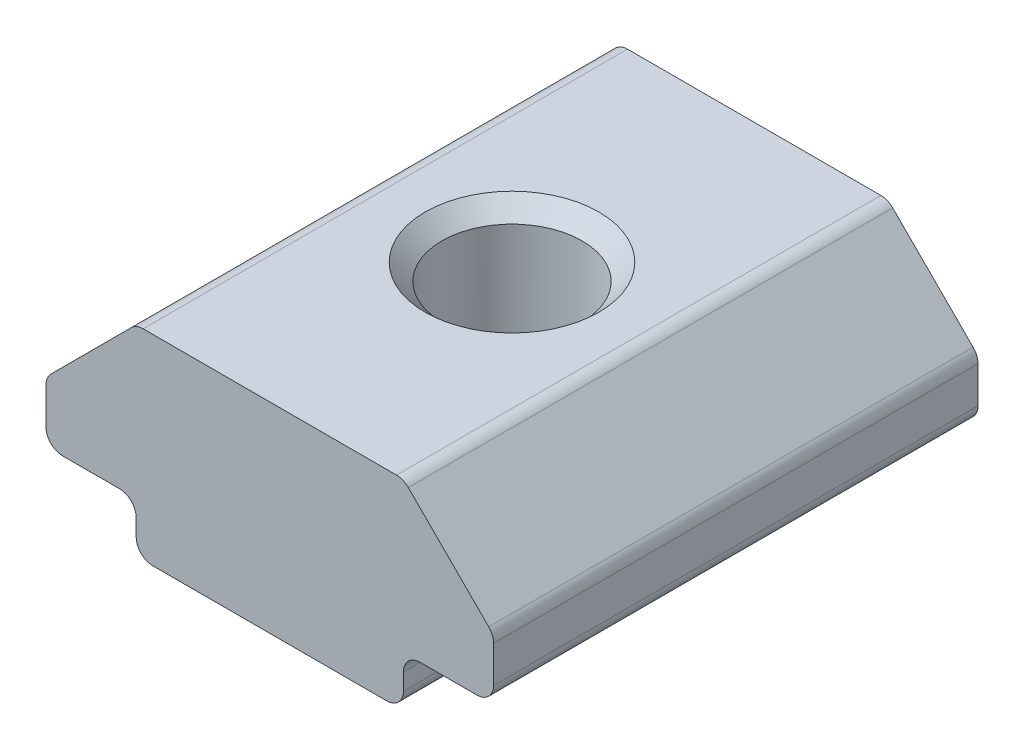
ISO-10303-21;
HEADER;
FILE_DESCRIPTION(('STEP AP214'),'2;1');
FILE_NAME('part.step','',(''),(''),'','','');
FILE_SCHEMA(('AUTOMOTIVE_DESIGN { 1 0 10303 214 1 1 1 1 }'));
ENDSEC;
DATA;
#1=APPLICATION_CONTEXT('core data for automotive mechanical design processes');
#2=APPLICATION_PROTOCOL_DEFINITION('international standard','automotive_design',2000,#1);
#3=PRODUCT_CONTEXT('',#1,'mechanical');
#4=PRODUCT('Part','Part','',(#3));
#5=PRODUCT_RELATED_PRODUCT_CATEGORY('part','',(#4));
#6=PRODUCT_DEFINITION_FORMATION('','',#4);
#7=PRODUCT_DEFINITION_CONTEXT('part definition',#1,'design');
#8=PRODUCT_DEFINITION('design','',#6,#7);
#9=PRODUCT_DEFINITION_SHAPE('','',#8);
#10=(LENGTH_UNIT() NAMED_UNIT(*) SI_UNIT(.MILLI.,.METRE.));
#11=(NAMED_UNIT(*) PLANE_ANGLE_UNIT() SI_UNIT($,.RADIAN.));
#12=(NAMED_UNIT(*) SI_UNIT($,.STERADIAN.) SOLID_ANGLE_UNIT());
#13=UNCERTAINTY_MEASURE_WITH_UNIT(LENGTH_MEASURE(1.E-05),#10,'distance_accuracy_value','');
#14=(GEOMETRIC_REPRESENTATION_CONTEXT(3) GLOBAL_UNCERTAINTY_ASSIGNED_CONTEXT((#13)) GLOBAL_UNIT_ASSIGNED_CONTEXT((#10,
#11,#12)) REPRESENTATION_CONTEXT('',''));
#15=CARTESIAN_POINT('',(0.,0.,0.));
#16=DIRECTION('',(0.,0.,1.));
#17=DIRECTION('',(1.,0.,0.));
#18=AXIS2_PLACEMENT_3D('',#15,#16,#17);
#19=CARTESIAN_POINT('',(-5.44683172709392,0.709717631728837,6.48747320730172));
#20=DIRECTION('',(1.,0.,0.));
#21=DIRECTION('',(0.,0.,-1.));
#22=AXIS2_PLACEMENT_3D('',#19,#20,#21);
#23=PLANE('',#22);
#24=DIRECTION('',(0.,-1.,0.));
#25=VECTOR('',#24,1.);
#26=CARTESIAN_POINT('',(-5.44683172709392,0.709717631728837,6.48747320730172));
#27=LINE('',#26,#25);
#28=CARTESIAN_POINT('',(-5.44683172709392,0.209717631728837,6.48747320730172));
#29=VERTEX_POINT('',#28);
#30=CARTESIAN_POINT('',(-5.44683172709392,-0.290282368271163,6.48747320730172));
#31=VERTEX_POINT('',#30);
#32=EDGE_CURVE('E204',#29,#31,#27,.T.);
#33=ORIENTED_EDGE('',*,*,#32,.F.);
#34=DIRECTION('',(0.,0.,-1.));
#35=VECTOR('',#34,1.);
#36=CARTESIAN_POINT('',(-5.44683172709392,0.209717631728837,-8.01252679269828));
#37=LINE('',#36,#35);
#38=CARTESIAN_POINT('',(-5.44683172709392,0.209717631728837,-8.01252679269828));
#39=VERTEX_POINT('',#38);
#40=EDGE_CURVE('E288',#29,#39,#37,.T.);
#41=ORIENTED_EDGE('',*,*,#40,.T.);
#42=DIRECTION('',(0.,-1.,0.));
#43=VECTOR('',#42,1.);
#44=CARTESIAN_POINT('',(-5.44683172709392,0.709717631728837,-8.01252679269828));
#45=LINE('',#44,#43);
#46=CARTESIAN_POINT('',(-5.44683172709392,-0.290282368271163,-8.01252679269828));
#47=VERTEX_POINT('',#46);
#48=EDGE_CURVE('E178',#39,#47,#45,.T.);
#49=ORIENTED_EDGE('',*,*,#48,.T.);
#50=DIRECTION('',(0.,0.,-1.));
#51=VECTOR('',#50,1.);
#52=CARTESIAN_POINT('',(-5.44683172709392,-0.290282368271163,6.48747320730172));
#53=LINE('',#52,#51);
#54=EDGE_CURVE('E160',#47,#31,#53,.F.);
#55=ORIENTED_EDGE('',*,*,#54,.T.);
#56=EDGE_LOOP('',(#33,#41,#49,#55));
#57=FACE_BOUND('',#56,.T.);
#58=ADVANCED_FACE('F16',(#57),#23,.F.);
#59=CARTESIAN_POINT('',(-5.44683172709392,-0.790282368271163,6.48747320730172));
#60=DIRECTION('',(0.,1.,0.));
#61=DIRECTION('',(0.,0.,1.));
#62=AXIS2_PLACEMENT_3D('',#59,#60,#61);
#63=PLANE('',#62);
#64=CARTESIAN_POINT('',(-1.44683172709392,-0.790282368271163,-0.762526792698281));
#65=DIRECTION('',(0.,1.,0.));
#66=DIRECTION('',(0.,0.,1.));
#67=AXIS2_PLACEMENT_3D('',#64,#65,#66);
#68=CIRCLE('',#67,2.6);
#69=CARTESIAN_POINT('',(-1.44683172709392,-0.790282368271163,1.83747320730171));
#70=VERTEX_POINT('',#69);
#71=EDGE_CURVE('E271',#70,#70,#68,.T.);
#72=ORIENTED_EDGE('',*,*,#71,.T.);
#73=EDGE_LOOP('',(#72));
#74=FACE_BOUND('',#73,.T.);
#75=DIRECTION('',(1.,0.,0.));
#76=VECTOR('',#75,1.);
#77=CARTESIAN_POINT('',(-5.44683172709392,-0.790282368271163,6.48747320730172));
#78=LINE('',#77,#76);
#79=CARTESIAN_POINT('',(-4.94683172709392,-0.790282368271163,6.48747320730172));
#80=VERTEX_POINT('',#79);
#81=CARTESIAN_POINT('',(2.05316827290608,-0.790282368271163,6.48747320730172));
#82=VERTEX_POINT('',#81);
#83=EDGE_CURVE('E171',#80,#82,#78,.T.);
#84=ORIENTED_EDGE('',*,*,#83,.F.);
#85=DIRECTION('',(0.,0.,-1.));
#86=VECTOR('',#85,1.);
#87=CARTESIAN_POINT('',(-4.94683172709392,-0.790282368271163,6.48747320730172));
#88=LINE('',#87,#86);
#89=CARTESIAN_POINT('',(-4.94683172709392,-0.790282368271163,-8.01252679269828));
#90=VERTEX_POINT('',#89);
#91=EDGE_CURVE('E158',#80,#90,#88,.T.);
#92=ORIENTED_EDGE('',*,*,#91,.T.);
#93=DIRECTION('',(1.,0.,0.));
#94=VECTOR('',#93,1.);
#95=CARTESIAN_POINT('',(-5.44683172709392,-0.790282368271163,-8.01252679269828));
#96=LINE('',#95,#94);
#97=CARTESIAN_POINT('',(2.05316827290608,-0.790282368271163,-8.01252679269828));
#98=VERTEX_POINT('',#97);
#99=EDGE_CURVE('E168',#90,#98,#96,.T.);
#100=ORIENTED_EDGE('',*,*,#99,.T.);
#101=DIRECTION('',(0.,0.,-1.));
#102=VECTOR('',#101,1.);
#103=CARTESIAN_POINT('',(2.05316827290608,-0.790282368271163,6.48747320730172));
#104=LINE('',#103,#102);
#105=EDGE_CURVE('E173',#98,#82,#104,.F.);
#106=ORIENTED_EDGE('',*,*,#105,.T.);
#107=EDGE_LOOP('',(#84,#92,#100,#106));
#108=FACE_BOUND('',#107,.T.);
#109=ADVANCED_FACE('F167',(#74,#108),#63,.F.);
#110=CARTESIAN_POINT('',(2.55316827290608,-0.790282368271163,6.48747320730172));
#111=DIRECTION('',(-1.,0.,0.));
#112=DIRECTION('',(0.,0.,1.));
#113=AXIS2_PLACEMENT_3D('',#110,#111,#112);
#114=PLANE('',#113);
#115=DIRECTION('',(0.,1.,0.));
#116=VECTOR('',#115,1.);
#117=CARTESIAN_POINT('',(2.55316827290608,-0.790282368271163,-8.01252679269828));
#118=LINE('',#117,#116);
#119=CARTESIAN_POINT('',(2.55316827290608,-0.290282368271164,-8.01252679269828));
#120=VERTEX_POINT('',#119);
#121=CARTESIAN_POINT('',(2.55316827290608,0.209717631728837,-8.01252679269828));
#122=VERTEX_POINT('',#121);
#123=EDGE_CURVE('E177',#120,#122,#118,.T.);
#124=ORIENTED_EDGE('',*,*,#123,.T.);
#125=DIRECTION('',(0.,0.,-1.));
#126=VECTOR('',#125,1.);
#127=CARTESIAN_POINT('',(2.55316827290608,0.209717631728837,6.48747320730172));
#128=LINE('',#127,#126);
#129=CARTESIAN_POINT('',(2.55316827290608,0.209717631728837,6.48747320730172));
#130=VERTEX_POINT('',#129);
#131=EDGE_CURVE('E286',#122,#130,#128,.F.);
#132=ORIENTED_EDGE('',*,*,#131,.T.);
#133=DIRECTION('',(0.,1.,0.));
#134=VECTOR('',#133,1.);
#135=CARTESIAN_POINT('',(2.55316827290608,-0.790282368271163,6.48747320730172));
#136=LINE('',#135,#134);
#137=CARTESIAN_POINT('',(2.55316827290608,-0.290282368271164,6.48747320730172));
#138=VERTEX_POINT('',#137);
#139=EDGE_CURVE('E302',#138,#130,#136,.T.);
#140=ORIENTED_EDGE('',*,*,#139,.F.);
#141=DIRECTION('',(0.,0.,-1.));
#142=VECTOR('',#141,1.);
#143=CARTESIAN_POINT('',(2.55316827290608,-0.290282368271164,6.48747320730172));
#144=LINE('',#143,#142);
#145=EDGE_CURVE('E268',#138,#120,#144,.T.);
#146=ORIENTED_EDGE('',*,*,#145,.T.);
#147=EDGE_LOOP('',(#124,#132,#140,#146));
#148=FACE_BOUND('',#147,.T.);
#149=ADVANCED_FACE('F315',(#148),#114,.F.);
#150=CARTESIAN_POINT('',(2.55316827290608,0.709717631728837,6.48747320730172));
#151=DIRECTION('',(0.,1.,0.));
#152=DIRECTION('',(0.,0.,1.));
#153=AXIS2_PLACEMENT_3D('',#150,#151,#152);
#154=PLANE('',#153);
#155=DIRECTION('',(1.,0.,0.));
#156=VECTOR('',#155,1.);
#157=CARTESIAN_POINT('',(2.55316827290608,0.709717631728837,6.48747320730172));
#158=LINE('',#157,#156);
#159=CARTESIAN_POINT('',(3.05316827290608,0.709717631728837,6.48747320730172));
#160=VERTEX_POINT('',#159);
#161=CARTESIAN_POINT('',(4.75316827290608,0.709717631728837,6.48747320730172));
#162=VERTEX_POINT('',#161);
#163=EDGE_CURVE('E300',#160,#162,#158,.T.);
#164=ORIENTED_EDGE('',*,*,#163,.F.);
#165=DIRECTION('',(0.,0.,-1.));
#166=VECTOR('',#165,1.);
#167=CARTESIAN_POINT('',(3.05316827290608,0.709717631728837,-8.01252679269828));
#168=LINE('',#167,#166);
#169=CARTESIAN_POINT('',(3.05316827290608,0.709717631728837,-8.01252679269828));
#170=VERTEX_POINT('',#169);
#171=EDGE_CURVE('E283',#160,#170,#168,.T.);
#172=ORIENTED_EDGE('',*,*,#171,.T.);
#173=DIRECTION('',(1.,0.,0.));
#174=VECTOR('',#173,1.);
#175=CARTESIAN_POINT('',(2.55316827290608,0.709717631728837,-8.01252679269828));
#176=LINE('',#175,#174);
#177=CARTESIAN_POINT('',(4.75316827290608,0.709717631728837,-8.01252679269828));
#178=VERTEX_POINT('',#177);
#179=EDGE_CURVE('E181',#170,#178,#176,.T.);
#180=ORIENTED_EDGE('',*,*,#179,.T.);
#181=DIRECTION('',(0.,0.,-1.));
#182=VECTOR('',#181,1.);
#183=CARTESIAN_POINT('',(4.75316827290608,0.709717631728837,6.48747320730172));
#184=LINE('',#183,#182);
#185=EDGE_CURVE('E265',#178,#162,#184,.F.);
#186=ORIENTED_EDGE('',*,*,#185,.T.);
#187=EDGE_LOOP('',(#164,#172,#180,#186));
#188=FACE_BOUND('',#187,.T.);
#189=ADVANCED_FACE('F307',(#188),#154,.F.);
#190=CARTESIAN_POINT('',(5.25316827290608,0.709717631728837,6.48747320730172));
#191=DIRECTION('',(-1.,0.,0.));
#192=DIRECTION('',(0.,0.,1.));
#193=AXIS2_PLACEMENT_3D('',#190,#191,#192);
#194=PLANE('',#193);
#195=DIRECTION('',(0.,1.,0.));
#196=VECTOR('',#195,1.);
#197=CARTESIAN_POINT('',(5.25316827290608,0.709717631728837,-8.01252679269828));
#198=LINE('',#197,#196);
#199=CARTESIAN_POINT('',(5.25316827290608,1.20971763172884,-8.01252679269828));
#200=VERTEX_POINT('',#199);
#201=CARTESIAN_POINT('',(5.25316827290608,2.3026108505423,-8.01252679269828));
#202=VERTEX_POINT('',#201);
#203=EDGE_CURVE('E187',#200,#202,#198,.T.);
#204=ORIENTED_EDGE('',*,*,#203,.T.);
#205=DIRECTION('',(0.,0.,-1.));
#206=VECTOR('',#205,1.);
#207=CARTESIAN_POINT('',(5.25316827290608,2.3026108505423,6.48747320730172));
#208=LINE('',#207,#206);
#209=CARTESIAN_POINT('',(5.25316827290608,2.3026108505423,6.48747320730172));
#210=VERTEX_POINT('',#209);
#211=EDGE_CURVE('E263',#202,#210,#208,.F.);
#212=ORIENTED_EDGE('',*,*,#211,.T.);
#213=DIRECTION('',(0.,1.,0.));
#214=VECTOR('',#213,1.);
#215=CARTESIAN_POINT('',(5.25316827290608,0.709717631728837,6.48747320730172));
#216=LINE('',#215,#214);
#217=CARTESIAN_POINT('',(5.25316827290608,1.20971763172884,6.48747320730172));
#218=VERTEX_POINT('',#217);
#219=EDGE_CURVE('E311',#218,#210,#216,.T.);
#220=ORIENTED_EDGE('',*,*,#219,.F.);
#221=DIRECTION('',(0.,0.,-1.));
#222=VECTOR('',#221,1.);
#223=CARTESIAN_POINT('',(5.25316827290608,1.20971763172884,6.48747320730172));
#224=LINE('',#223,#222);
#225=EDGE_CURVE('E260',#218,#200,#224,.T.);
#226=ORIENTED_EDGE('',*,*,#225,.T.);
#227=EDGE_LOOP('',(#204,#212,#220,#226));
#228=FACE_BOUND('',#227,.T.);
#229=ADVANCED_FACE('F541',(#228),#194,.F.);
#230=CARTESIAN_POINT('',(5.25316827290608,2.50971763172885,6.48747320730172));
#231=DIRECTION('',(-0.707106781186546,-0.707106781186549,0.));
#232=DIRECTION('',(0.707106781186549,-0.707106781186546,0.));
#233=AXIS2_PLACEMENT_3D('',#230,#231,#232);
#234=PLANE('',#233);
#235=DIRECTION('',(-0.707106781186549,0.707106781186546,0.));
#236=VECTOR('',#235,1.);
#237=CARTESIAN_POINT('',(5.25316827290608,2.50971763172885,-8.01252679269828));
#238=LINE('',#237,#236);
#239=CARTESIAN_POINT('',(5.10672166349935,2.65616424113557,-8.01252679269828));
#240=VERTEX_POINT('',#239);
#241=CARTESIAN_POINT('',(2.6996148823128,5.06327102232211,-8.01252679269828));
#242=VERTEX_POINT('',#241);
#243=EDGE_CURVE('E190',#240,#242,#238,.T.);
#244=ORIENTED_EDGE('',*,*,#243,.T.);
#245=DIRECTION('',(0.,0.,-1.));
#246=VECTOR('',#245,1.);
#247=CARTESIAN_POINT('',(2.6996148823128,5.06327102232211,6.48747320730172));
#248=LINE('',#247,#246);
#249=CARTESIAN_POINT('',(2.6996148823128,5.06327102232211,6.48747320730172));
#250=VERTEX_POINT('',#249);
#251=EDGE_CURVE('E258',#242,#250,#248,.F.);
#252=ORIENTED_EDGE('',*,*,#251,.T.);
#253=DIRECTION('',(-0.707106781186549,0.707106781186546,0.));
#254=VECTOR('',#253,1.);
#255=CARTESIAN_POINT('',(5.25316827290608,2.50971763172885,6.48747320730172));
#256=LINE('',#255,#254);
#257=CARTESIAN_POINT('',(5.10672166349935,2.65616424113557,6.48747320730172));
#258=VERTEX_POINT('',#257);
#259=EDGE_CURVE('E326',#258,#250,#256,.T.);
#260=ORIENTED_EDGE('',*,*,#259,.F.);
#261=DIRECTION('',(0.,0.,-1.));
#262=VECTOR('',#261,1.);
#263=CARTESIAN_POINT('',(5.10672166349935,2.65616424113557,6.48747320730172));
#264=LINE('',#263,#262);
#265=EDGE_CURVE('E255',#258,#240,#264,.T.);
#266=ORIENTED_EDGE('',*,*,#265,.T.);
#267=EDGE_LOOP('',(#244,#252,#260,#266));
#268=FACE_BOUND('',#267,.T.);
#269=ADVANCED_FACE('F531',(#268),#234,.F.);
#270=CARTESIAN_POINT('',(2.55316827290608,5.20971763172883,6.48747320730172));
#271=DIRECTION('',(0.,-1.,0.));
#272=DIRECTION('',(0.,0.,-1.));
#273=AXIS2_PLACEMENT_3D('',#270,#271,#272);
#274=PLANE('',#273);
#275=CARTESIAN_POINT('',(-1.44683172709392,5.20971763172883,-0.762526792698281));
#276=DIRECTION('',(0.,-1.,0.));
#277=DIRECTION('',(0.,0.,-1.));
#278=AXIS2_PLACEMENT_3D('',#275,#276,#277);
#279=CIRCLE('',#278,2.6);
#280=CARTESIAN_POINT('',(-1.44683172709392,5.20971763172883,-3.36252679269828));
#281=VERTEX_POINT('',#280);
#282=EDGE_CURVE('E280',#281,#281,#279,.T.);
#283=ORIENTED_EDGE('',*,*,#282,.T.);
#284=EDGE_LOOP('',(#283));
#285=FACE_BOUND('',#284,.T.);
#286=DIRECTION('',(-1.,0.,0.));
#287=VECTOR('',#286,1.);
#288=CARTESIAN_POINT('',(2.55316827290608,5.20971763172883,-8.01252679269828));
#289=LINE('',#288,#287);
#290=CARTESIAN_POINT('',(2.34606149171953,5.20971763172883,-8.01252679269828));
#291=VERTEX_POINT('',#290);
#292=CARTESIAN_POINT('',(-5.23972494590737,5.20971763172883,-8.01252679269828));
#293=VERTEX_POINT('',#292);
#294=EDGE_CURVE('E193',#291,#293,#289,.T.);
#295=ORIENTED_EDGE('',*,*,#294,.T.);
#296=DIRECTION('',(0.,0.,-1.));
#297=VECTOR('',#296,1.);
#298=CARTESIAN_POINT('',(-5.23972494590737,5.20971763172883,6.48747320730172));
#299=LINE('',#298,#297);
#300=CARTESIAN_POINT('',(-5.23972494590737,5.20971763172883,6.48747320730172));
#301=VERTEX_POINT('',#300);
#302=EDGE_CURVE('E253',#293,#301,#299,.F.);
#303=ORIENTED_EDGE('',*,*,#302,.T.);
#304=DIRECTION('',(-1.,0.,0.));
#305=VECTOR('',#304,1.);
#306=CARTESIAN_POINT('',(2.55316827290608,5.20971763172883,6.48747320730172));
#307=LINE('',#306,#305);
#308=CARTESIAN_POINT('',(2.34606149171953,5.20971763172883,6.48747320730172));
#309=VERTEX_POINT('',#308);
#310=EDGE_CURVE('E329',#309,#301,#307,.T.);
#311=ORIENTED_EDGE('',*,*,#310,.F.);
#312=DIRECTION('',(0.,0.,-1.));
#313=VECTOR('',#312,1.);
#314=CARTESIAN_POINT('',(2.34606149171953,5.20971763172883,6.48747320730172));
#315=LINE('',#314,#313);
#316=EDGE_CURVE('E250',#309,#291,#315,.T.);
#317=ORIENTED_EDGE('',*,*,#316,.T.);
#318=EDGE_LOOP('',(#295,#303,#311,#317));
#319=FACE_BOUND('',#318,.T.);
#320=ADVANCED_FACE('F521',(#285,#319),#274,.F.);
#321=CARTESIAN_POINT('',(-8.14683172709392,2.50971763172884,6.48747320730172));
#322=DIRECTION('',(0.707106781186546,-0.707106781186549,0.));
#323=DIRECTION('',(0.707106781186549,0.707106781186546,0.));
#324=AXIS2_PLACEMENT_3D('',#321,#322,#323);
#325=PLANE('',#324);
#326=DIRECTION('',(-0.707106781186549,-0.707106781186546,0.));
#327=VECTOR('',#326,1.);
#328=CARTESIAN_POINT('',(-8.14683172709392,2.50971763172884,-8.01252679269828));
#329=LINE('',#328,#327);
#330=CARTESIAN_POINT('',(-5.59327833650065,5.06327102232211,-8.01252679269828));
#331=VERTEX_POINT('',#330);
#332=CARTESIAN_POINT('',(-8.00038511768719,2.65616424113557,-8.01252679269828));
#333=VERTEX_POINT('',#332);
#334=EDGE_CURVE('E196',#331,#333,#329,.T.);
#335=ORIENTED_EDGE('',*,*,#334,.T.);
#336=DIRECTION('',(0.,0.,-1.));
#337=VECTOR('',#336,1.);
#338=CARTESIAN_POINT('',(-8.00038511768719,2.65616424113557,6.48747320730172));
#339=LINE('',#338,#337);
#340=CARTESIAN_POINT('',(-8.00038511768719,2.65616424113557,6.48747320730172));
#341=VERTEX_POINT('',#340);
#342=EDGE_CURVE('E248',#333,#341,#339,.F.);
#343=ORIENTED_EDGE('',*,*,#342,.T.);
#344=DIRECTION('',(-0.707106781186549,-0.707106781186546,0.));
#345=VECTOR('',#344,1.);
#346=CARTESIAN_POINT('',(-8.14683172709392,2.50971763172884,6.48747320730172));
#347=LINE('',#346,#345);
#348=CARTESIAN_POINT('',(-5.59327833650065,5.06327102232211,6.48747320730172));
#349=VERTEX_POINT('',#348);
#350=EDGE_CURVE('E332',#349,#341,#347,.T.);
#351=ORIENTED_EDGE('',*,*,#350,.F.);
#352=DIRECTION('',(0.,0.,-1.));
#353=VECTOR('',#352,1.);
#354=CARTESIAN_POINT('',(-5.59327833650065,5.06327102232211,6.48747320730172));
#355=LINE('',#354,#353);
#356=EDGE_CURVE('E245',#349,#331,#355,.T.);
#357=ORIENTED_EDGE('',*,*,#356,.T.);
#358=EDGE_LOOP('',(#335,#343,#351,#357));
#359=FACE_BOUND('',#358,.T.);
#360=ADVANCED_FACE('F511',(#359),#325,.F.);
#361=CARTESIAN_POINT('',(-8.14683172709392,0.709717631728837,6.48747320730172));
#362=DIRECTION('',(1.,0.,0.));
#363=DIRECTION('',(0.,0.,-1.));
#364=AXIS2_PLACEMENT_3D('',#361,#362,#363);
#365=PLANE('',#364);
#366=DIRECTION('',(0.,-1.,0.));
#367=VECTOR('',#366,1.);
#368=CARTESIAN_POINT('',(-8.14683172709392,0.709717631728837,-8.01252679269828));
#369=LINE('',#368,#367);
#370=CARTESIAN_POINT('',(-8.14683172709392,2.3026108505423,-8.01252679269828));
#371=VERTEX_POINT('',#370);
#372=CARTESIAN_POINT('',(-8.14683172709392,1.20971763172884,-8.01252679269828));
#373=VERTEX_POINT('',#372);
#374=EDGE_CURVE('E199',#371,#373,#369,.T.);
#375=ORIENTED_EDGE('',*,*,#374,.T.);
#376=DIRECTION('',(0.,0.,-1.));
#377=VECTOR('',#376,1.);
#378=CARTESIAN_POINT('',(-8.14683172709392,1.20971763172884,6.48747320730172));
#379=LINE('',#378,#377);
#380=CARTESIAN_POINT('',(-8.14683172709392,1.20971763172884,6.48747320730172));
#381=VERTEX_POINT('',#380);
#382=EDGE_CURVE('E243',#373,#381,#379,.F.);
#383=ORIENTED_EDGE('',*,*,#382,.T.);
#384=DIRECTION('',(0.,-1.,0.));
#385=VECTOR('',#384,1.);
#386=CARTESIAN_POINT('',(-8.14683172709392,0.709717631728837,6.48747320730172));
#387=LINE('',#386,#385);
#388=CARTESIAN_POINT('',(-8.14683172709392,2.3026108505423,6.48747320730172));
#389=VERTEX_POINT('',#388);
#390=EDGE_CURVE('E335',#389,#381,#387,.T.);
#391=ORIENTED_EDGE('',*,*,#390,.F.);
#392=DIRECTION('',(0.,0.,-1.));
#393=VECTOR('',#392,1.);
#394=CARTESIAN_POINT('',(-8.14683172709392,2.3026108505423,6.48747320730172));
#395=LINE('',#394,#393);
#396=EDGE_CURVE('E240',#389,#371,#395,.T.);
#397=ORIENTED_EDGE('',*,*,#396,.T.);
#398=EDGE_LOOP('',(#375,#383,#391,#397));
#399=FACE_BOUND('',#398,.T.);
#400=ADVANCED_FACE('F502',(#399),#365,.F.);
#401=CARTESIAN_POINT('',(-8.14683172709392,0.709717631728837,6.48747320730172));
#402=DIRECTION('',(0.,1.,0.));
#403=DIRECTION('',(0.,0.,1.));
#404=AXIS2_PLACEMENT_3D('',#401,#402,#403);
#405=PLANE('',#404);
#406=DIRECTION('',(1.,0.,0.));
#407=VECTOR('',#406,1.);
#408=CARTESIAN_POINT('',(-8.14683172709392,0.709717631728837,-8.01252679269828));
#409=LINE('',#408,#407);
#410=CARTESIAN_POINT('',(-7.64683172709392,0.709717631728837,-8.01252679269828));
#411=VERTEX_POINT('',#410);
#412=CARTESIAN_POINT('',(-5.94683172709392,0.709717631728837,-8.01252679269828));
#413=VERTEX_POINT('',#412);
#414=EDGE_CURVE('E202',#411,#413,#409,.T.);
#415=ORIENTED_EDGE('',*,*,#414,.T.);
#416=DIRECTION('',(0.,0.,-1.));
#417=VECTOR('',#416,1.);
#418=CARTESIAN_POINT('',(-5.94683172709392,0.709717631728837,6.48747320730172));
#419=LINE('',#418,#417);
#420=CARTESIAN_POINT('',(-5.94683172709392,0.709717631728837,6.48747320730172));
#421=VERTEX_POINT('',#420);
#422=EDGE_CURVE('E37',#413,#421,#419,.F.);
#423=ORIENTED_EDGE('',*,*,#422,.T.);
#424=DIRECTION('',(1.,0.,0.));
#425=VECTOR('',#424,1.);
#426=CARTESIAN_POINT('',(-8.14683172709392,0.709717631728837,6.48747320730172));
#427=LINE('',#426,#425);
#428=CARTESIAN_POINT('',(-7.64683172709392,0.709717631728837,6.48747320730172));
#429=VERTEX_POINT('',#428);
#430=EDGE_CURVE('E205',#429,#421,#427,.T.);
#431=ORIENTED_EDGE('',*,*,#430,.F.);
#432=DIRECTION('',(0.,0.,-1.));
#433=VECTOR('',#432,1.);
#434=CARTESIAN_POINT('',(-7.64683172709392,0.709717631728837,6.48747320730172));
#435=LINE('',#434,#433);
#436=EDGE_CURVE('E237',#429,#411,#435,.T.);
#437=ORIENTED_EDGE('',*,*,#436,.T.);
#438=EDGE_LOOP('',(#415,#423,#431,#437));
#439=FACE_BOUND('',#438,.T.);
#440=ADVANCED_FACE('F493',(#439),#405,.F.);
#441=CARTESIAN_POINT('',(-1.44683172709392,-0.790282368271163,6.48747320730172));
#442=DIRECTION('',(0.,0.,1.));
#443=DIRECTION('',(1.,0.,0.));
#444=AXIS2_PLACEMENT_3D('',#441,#442,#443);
#445=PLANE('',#444);
#446=ORIENTED_EDGE('',*,*,#430,.T.);
#447=CARTESIAN_POINT('',(-5.94683172709392,0.209717631728837,6.48747320730172));
#448=DIRECTION('',(0.,0.,1.));
#449=DIRECTION('',(1.,0.,0.));
#450=AXIS2_PLACEMENT_3D('',#447,#448,#449);
#451=CIRCLE('',#450,0.5);
#452=EDGE_CURVE('E10',#421,#29,#451,.F.);
#453=ORIENTED_EDGE('',*,*,#452,.T.);
#454=ORIENTED_EDGE('',*,*,#32,.T.);
#455=CARTESIAN_POINT('',(-4.94683172709392,-0.290282368271163,6.48747320730172));
#456=DIRECTION('',(0.,0.,1.));
#457=DIRECTION('',(1.,0.,0.));
#458=AXIS2_PLACEMENT_3D('',#455,#456,#457);
#459=CIRCLE('',#458,0.5);
#460=EDGE_CURVE('E235',#31,#80,#459,.T.);
#461=ORIENTED_EDGE('',*,*,#460,.T.);
#462=ORIENTED_EDGE('',*,*,#83,.T.);
#463=CARTESIAN_POINT('',(2.05316827290608,-0.290282368271164,6.48747320730172));
#464=DIRECTION('',(0.,0.,1.));
#465=DIRECTION('',(1.,0.,0.));
#466=AXIS2_PLACEMENT_3D('',#463,#464,#465);
#467=CIRCLE('',#466,0.5);
#468=EDGE_CURVE('E221',#82,#138,#467,.T.);
#469=ORIENTED_EDGE('',*,*,#468,.T.);
#470=ORIENTED_EDGE('',*,*,#139,.T.);
#471=CARTESIAN_POINT('',(3.05316827290608,0.209717631728837,6.48747320730172));
#472=DIRECTION('',(0.,0.,1.));
#473=DIRECTION('',(1.,0.,0.));
#474=AXIS2_PLACEMENT_3D('',#471,#472,#473);
#475=CIRCLE('',#474,0.5);
#476=EDGE_CURVE('E294',#130,#160,#475,.F.);
#477=ORIENTED_EDGE('',*,*,#476,.T.);
#478=ORIENTED_EDGE('',*,*,#163,.T.);
#479=CARTESIAN_POINT('',(4.75316827290608,1.20971763172884,6.48747320730172));
#480=DIRECTION('',(0.,0.,1.));
#481=DIRECTION('',(1.,0.,0.));
#482=AXIS2_PLACEMENT_3D('',#479,#480,#481);
#483=CIRCLE('',#482,0.5);
#484=EDGE_CURVE('E223',#162,#218,#483,.T.);
#485=ORIENTED_EDGE('',*,*,#484,.T.);
#486=ORIENTED_EDGE('',*,*,#219,.T.);
#487=CARTESIAN_POINT('',(4.75316827290608,2.3026108505423,6.48747320730172));
#488=DIRECTION('',(0.,0.,1.));
#489=DIRECTION('',(1.,0.,0.));
#490=AXIS2_PLACEMENT_3D('',#487,#488,#489);
#491=CIRCLE('',#490,0.5);
#492=EDGE_CURVE('E225',#210,#258,#491,.T.);
#493=ORIENTED_EDGE('',*,*,#492,.T.);
#494=ORIENTED_EDGE('',*,*,#259,.T.);
#495=CARTESIAN_POINT('',(2.34606149171953,4.70971763172884,6.48747320730172));
#496=DIRECTION('',(0.,0.,1.));
#497=DIRECTION('',(1.,0.,0.));
#498=AXIS2_PLACEMENT_3D('',#495,#496,#497);
#499=CIRCLE('',#498,0.5);
#500=EDGE_CURVE('E227',#250,#309,#499,.T.);
#501=ORIENTED_EDGE('',*,*,#500,.T.);
#502=ORIENTED_EDGE('',*,*,#310,.T.);
#503=CARTESIAN_POINT('',(-5.23972494590737,4.70971763172884,6.48747320730172));
#504=DIRECTION('',(0.,0.,1.));
#505=DIRECTION('',(1.,0.,0.));
#506=AXIS2_PLACEMENT_3D('',#503,#504,#505);
#507=CIRCLE('',#506,0.5);
#508=EDGE_CURVE('E229',#301,#349,#507,.T.);
#509=ORIENTED_EDGE('',*,*,#508,.T.);
#510=ORIENTED_EDGE('',*,*,#350,.T.);
#511=CARTESIAN_POINT('',(-7.64683172709392,2.3026108505423,6.48747320730172));
#512=DIRECTION('',(0.,0.,1.));
#513=DIRECTION('',(1.,0.,0.));
#514=AXIS2_PLACEMENT_3D('',#511,#512,#513);
#515=CIRCLE('',#514,0.5);
#516=EDGE_CURVE('E231',#341,#389,#515,.T.);
#517=ORIENTED_EDGE('',*,*,#516,.T.);
#518=ORIENTED_EDGE('',*,*,#390,.T.);
#519=CARTESIAN_POINT('',(-7.64683172709392,1.20971763172884,6.48747320730172));
#520=DIRECTION('',(0.,0.,1.));
#521=DIRECTION('',(1.,0.,0.));
#522=AXIS2_PLACEMENT_3D('',#519,#520,#521);
#523=CIRCLE('',#522,0.5);
#524=EDGE_CURVE('E233',#381,#429,#523,.T.);
#525=ORIENTED_EDGE('',*,*,#524,.T.);
#526=EDGE_LOOP('',(#446,#453,#454,#461,#462,#469,#470,#477,#478,#485,#486,#493,#494,#501,#502,
#509,#510,#517,#518,#525));
#527=FACE_BOUND('',#526,.T.);
#528=ADVANCED_FACE('F299',(#527),#445,.T.);
#529=CARTESIAN_POINT('',(-1.44683172709392,-0.790282368271163,-8.01252679269828));
#530=DIRECTION('',(0.,0.,1.));
#531=DIRECTION('',(1.,0.,0.));
#532=AXIS2_PLACEMENT_3D('',#529,#530,#531);
#533=PLANE('',#532);
#534=ORIENTED_EDGE('',*,*,#99,.F.);
#535=CARTESIAN_POINT('',(-4.94683172709392,-0.290282368271163,-8.01252679269828));
#536=DIRECTION('',(0.,0.,1.));
#537=DIRECTION('',(1.,0.,0.));
#538=AXIS2_PLACEMENT_3D('',#535,#536,#537);
#539=CIRCLE('',#538,0.5);
#540=EDGE_CURVE('E154',#90,#47,#539,.F.);
#541=ORIENTED_EDGE('',*,*,#540,.T.);
#542=ORIENTED_EDGE('',*,*,#48,.F.);
#543=CARTESIAN_POINT('',(-5.94683172709392,0.209717631728837,-8.01252679269828));
#544=DIRECTION('',(0.,0.,1.));
#545=DIRECTION('',(1.,0.,0.));
#546=AXIS2_PLACEMENT_3D('',#543,#544,#545);
#547=CIRCLE('',#546,0.5);
#548=EDGE_CURVE('E24',#39,#413,#547,.T.);
#549=ORIENTED_EDGE('',*,*,#548,.T.);
#550=ORIENTED_EDGE('',*,*,#414,.F.);
#551=CARTESIAN_POINT('',(-7.64683172709392,1.20971763172884,-8.01252679269828));
#552=DIRECTION('',(0.,0.,1.));
#553=DIRECTION('',(1.,0.,0.));
#554=AXIS2_PLACEMENT_3D('',#551,#552,#553);
#555=CIRCLE('',#554,0.5);
#556=EDGE_CURVE('E162',#411,#373,#555,.F.);
#557=ORIENTED_EDGE('',*,*,#556,.T.);
#558=ORIENTED_EDGE('',*,*,#374,.F.);
#559=CARTESIAN_POINT('',(-7.64683172709392,2.3026108505423,-8.01252679269828));
#560=DIRECTION('',(0.,0.,1.));
#561=DIRECTION('',(1.,0.,0.));
#562=AXIS2_PLACEMENT_3D('',#559,#560,#561);
#563=CIRCLE('',#562,0.5);
#564=EDGE_CURVE('E217',#371,#333,#563,.F.);
#565=ORIENTED_EDGE('',*,*,#564,.T.);
#566=ORIENTED_EDGE('',*,*,#334,.F.);
#567=CARTESIAN_POINT('',(-5.23972494590737,4.70971763172884,-8.01252679269828));
#568=DIRECTION('',(0.,0.,1.));
#569=DIRECTION('',(1.,0.,0.));
#570=AXIS2_PLACEMENT_3D('',#567,#568,#569);
#571=CIRCLE('',#570,0.5);
#572=EDGE_CURVE('E215',#331,#293,#571,.F.);
#573=ORIENTED_EDGE('',*,*,#572,.T.);
#574=ORIENTED_EDGE('',*,*,#294,.F.);
#575=CARTESIAN_POINT('',(2.34606149171953,4.70971763172884,-8.01252679269828));
#576=DIRECTION('',(0.,0.,1.));
#577=DIRECTION('',(1.,0.,0.));
#578=AXIS2_PLACEMENT_3D('',#575,#576,#577);
#579=CIRCLE('',#578,0.5);
#580=EDGE_CURVE('E213',#291,#242,#579,.F.);
#581=ORIENTED_EDGE('',*,*,#580,.T.);
#582=ORIENTED_EDGE('',*,*,#243,.F.);
#583=CARTESIAN_POINT('',(4.75316827290608,2.3026108505423,-8.01252679269828));
#584=DIRECTION('',(0.,0.,1.));
#585=DIRECTION('',(1.,0.,0.));
#586=AXIS2_PLACEMENT_3D('',#583,#584,#585);
#587=CIRCLE('',#586,0.5);
#588=EDGE_CURVE('E211',#240,#202,#587,.F.);
#589=ORIENTED_EDGE('',*,*,#588,.T.);
#590=ORIENTED_EDGE('',*,*,#203,.F.);
#591=CARTESIAN_POINT('',(4.75316827290608,1.20971763172884,-8.01252679269828));
#592=DIRECTION('',(0.,0.,1.));
#593=DIRECTION('',(1.,0.,0.));
#594=AXIS2_PLACEMENT_3D('',#591,#592,#593);
#595=CIRCLE('',#594,0.5);
#596=EDGE_CURVE('E208',#200,#178,#595,.F.);
#597=ORIENTED_EDGE('',*,*,#596,.T.);
#598=ORIENTED_EDGE('',*,*,#179,.F.);
#599=CARTESIAN_POINT('',(3.05316827290608,0.209717631728837,-8.01252679269828));
#600=DIRECTION('',(0.,0.,1.));
#601=DIRECTION('',(1.,0.,0.));
#602=AXIS2_PLACEMENT_3D('',#599,#600,#601);
#603=CIRCLE('',#602,0.5);
#604=EDGE_CURVE('E292',#170,#122,#603,.T.);
#605=ORIENTED_EDGE('',*,*,#604,.T.);
#606=ORIENTED_EDGE('',*,*,#123,.F.);
#607=CARTESIAN_POINT('',(2.05316827290608,-0.290282368271164,-8.01252679269828));
#608=DIRECTION('',(0.,0.,1.));
#609=DIRECTION('',(1.,0.,0.));
#610=AXIS2_PLACEMENT_3D('',#607,#608,#609);
#611=CIRCLE('',#610,0.5);
#612=EDGE_CURVE('E172',#120,#98,#611,.F.);
#613=ORIENTED_EDGE('',*,*,#612,.T.);
#614=EDGE_LOOP('',(#534,#541,#542,#549,#550,#557,#558,#565,#566,#573,#574,#581,#582,#589,#590,
#597,#598,#605,#606,#613));
#615=FACE_BOUND('',#614,.T.);
#616=ADVANCED_FACE('F175',(#615),#533,.F.);
#617=CARTESIAN_POINT('',(-4.94683172709392,-0.290282368271163,6.48747320730172));
#618=DIRECTION('',(0.,0.,-1.));
#619=DIRECTION('',(-1.,0.,0.));
#620=AXIS2_PLACEMENT_3D('',#617,#618,#619);
#621=CYLINDRICAL_SURFACE('',#620,0.5);
#622=ORIENTED_EDGE('',*,*,#460,.F.);
#623=ORIENTED_EDGE('',*,*,#54,.F.);
#624=ORIENTED_EDGE('',*,*,#540,.F.);
#625=ORIENTED_EDGE('',*,*,#91,.F.);
#626=EDGE_LOOP('',(#622,#623,#624,#625));
#627=FACE_BOUND('',#626,.T.);
#628=ADVANCED_FACE('F157',(#627),#621,.T.);
#629=CARTESIAN_POINT('',(-7.64683172709392,1.20971763172884,6.48747320730172));
#630=DIRECTION('',(0.,0.,-1.));
#631=DIRECTION('',(-1.,0.,0.));
#632=AXIS2_PLACEMENT_3D('',#629,#630,#631);
#633=CYLINDRICAL_SURFACE('',#632,0.5);
#634=ORIENTED_EDGE('',*,*,#524,.F.);
#635=ORIENTED_EDGE('',*,*,#382,.F.);
#636=ORIENTED_EDGE('',*,*,#556,.F.);
#637=ORIENTED_EDGE('',*,*,#436,.F.);
#638=EDGE_LOOP('',(#634,#635,#636,#637));
#639=FACE_BOUND('',#638,.T.);
#640=ADVANCED_FACE('F356',(#639),#633,.T.);
#641=CARTESIAN_POINT('',(-7.64683172709392,2.3026108505423,6.48747320730172));
#642=DIRECTION('',(0.,0.,-1.));
#643=DIRECTION('',(-1.,0.,0.));
#644=AXIS2_PLACEMENT_3D('',#641,#642,#643);
#645=CYLINDRICAL_SURFACE('',#644,0.5);
#646=ORIENTED_EDGE('',*,*,#516,.F.);
#647=ORIENTED_EDGE('',*,*,#342,.F.);
#648=ORIENTED_EDGE('',*,*,#564,.F.);
#649=ORIENTED_EDGE('',*,*,#396,.F.);
#650=EDGE_LOOP('',(#646,#647,#648,#649));
#651=FACE_BOUND('',#650,.T.);
#652=ADVANCED_FACE('F359',(#651),#645,.T.);
#653=CARTESIAN_POINT('',(-5.23972494590737,4.70971763172884,6.48747320730172));
#654=DIRECTION('',(0.,0.,-1.));
#655=DIRECTION('',(-1.,0.,0.));
#656=AXIS2_PLACEMENT_3D('',#653,#654,#655);
#657=CYLINDRICAL_SURFACE('',#656,0.5);
#658=ORIENTED_EDGE('',*,*,#508,.F.);
#659=ORIENTED_EDGE('',*,*,#302,.F.);
#660=ORIENTED_EDGE('',*,*,#572,.F.);
#661=ORIENTED_EDGE('',*,*,#356,.F.);
#662=EDGE_LOOP('',(#658,#659,#660,#661));
#663=FACE_BOUND('',#662,.T.);
#664=ADVANCED_FACE('F363',(#663),#657,.T.);
#665=CARTESIAN_POINT('',(2.34606149171953,4.70971763172884,6.48747320730172));
#666=DIRECTION('',(0.,0.,-1.));
#667=DIRECTION('',(-1.,0.,0.));
#668=AXIS2_PLACEMENT_3D('',#665,#666,#667);
#669=CYLINDRICAL_SURFACE('',#668,0.5);
#670=ORIENTED_EDGE('',*,*,#500,.F.);
#671=ORIENTED_EDGE('',*,*,#251,.F.);
#672=ORIENTED_EDGE('',*,*,#580,.F.);
#673=ORIENTED_EDGE('',*,*,#316,.F.);
#674=EDGE_LOOP('',(#670,#671,#672,#673));
#675=FACE_BOUND('',#674,.T.);
#676=ADVANCED_FACE('F367',(#675),#669,.T.);
#677=CARTESIAN_POINT('',(4.75316827290608,2.3026108505423,6.48747320730172));
#678=DIRECTION('',(0.,0.,-1.));
#679=DIRECTION('',(-1.,0.,0.));
#680=AXIS2_PLACEMENT_3D('',#677,#678,#679);
#681=CYLINDRICAL_SURFACE('',#680,0.5);
#682=ORIENTED_EDGE('',*,*,#492,.F.);
#683=ORIENTED_EDGE('',*,*,#211,.F.);
#684=ORIENTED_EDGE('',*,*,#588,.F.);
#685=ORIENTED_EDGE('',*,*,#265,.F.);
#686=EDGE_LOOP('',(#682,#683,#684,#685));
#687=FACE_BOUND('',#686,.T.);
#688=ADVANCED_FACE('F371',(#687),#681,.T.);
#689=CARTESIAN_POINT('',(4.75316827290608,1.20971763172884,6.48747320730172));
#690=DIRECTION('',(0.,0.,-1.));
#691=DIRECTION('',(-1.,0.,0.));
#692=AXIS2_PLACEMENT_3D('',#689,#690,#691);
#693=CYLINDRICAL_SURFACE('',#692,0.5);
#694=ORIENTED_EDGE('',*,*,#484,.F.);
#695=ORIENTED_EDGE('',*,*,#185,.F.);
#696=ORIENTED_EDGE('',*,*,#596,.F.);
#697=ORIENTED_EDGE('',*,*,#225,.F.);
#698=EDGE_LOOP('',(#694,#695,#696,#697));
#699=FACE_BOUND('',#698,.T.);
#700=ADVANCED_FACE('F375',(#699),#693,.T.);
#701=CARTESIAN_POINT('',(2.05316827290608,-0.290282368271164,6.48747320730172));
#702=DIRECTION('',(0.,0.,-1.));
#703=DIRECTION('',(-1.,0.,0.));
#704=AXIS2_PLACEMENT_3D('',#701,#702,#703);
#705=CYLINDRICAL_SURFACE('',#704,0.5);
#706=ORIENTED_EDGE('',*,*,#468,.F.);
#707=ORIENTED_EDGE('',*,*,#105,.F.);
#708=ORIENTED_EDGE('',*,*,#612,.F.);
#709=ORIENTED_EDGE('',*,*,#145,.F.);
#710=EDGE_LOOP('',(#706,#707,#708,#709));
#711=FACE_BOUND('',#710,.T.);
#712=ADVANCED_FACE('F319',(#711),#705,.T.);
#713=CARTESIAN_POINT('',(-1.44683172709392,-0.790282368271163,-0.762526792698281));
#714=DIRECTION('',(0.,1.,0.));
#715=DIRECTION('',(0.,0.,1.));
#716=AXIS2_PLACEMENT_3D('',#713,#714,#715);
#717=CYLINDRICAL_SURFACE('',#716,2.1);
#718=CARTESIAN_POINT('',(-1.44683172709392,-0.290282368271166,-0.762526792698281));
#719=DIRECTION('',(0.,1.,0.));
#720=DIRECTION('',(0.,0.,1.));
#721=AXIS2_PLACEMENT_3D('',#718,#719,#720);
#722=CIRCLE('',#721,2.1);
#723=CARTESIAN_POINT('',(-1.44683172709392,-0.290282368271166,1.33747320730172));
#724=VERTEX_POINT('',#723);
#725=EDGE_CURVE('E277',#724,#724,#722,.F.);
#726=ORIENTED_EDGE('',*,*,#725,.T.);
#727=EDGE_LOOP('',(#726));
#728=FACE_BOUND('',#727,.T.);
#729=CARTESIAN_POINT('',(-1.44683172709392,4.70971763172884,-0.762526792698281));
#730=DIRECTION('',(0.,-1.,0.));
#731=DIRECTION('',(0.,0.,-1.));
#732=AXIS2_PLACEMENT_3D('',#729,#730,#731);
#733=CIRCLE('',#732,2.1);
#734=CARTESIAN_POINT('',(-1.44683172709392,4.70971763172884,-2.86252679269828));
#735=VERTEX_POINT('',#734);
#736=EDGE_CURVE('E274',#735,#735,#733,.F.);
#737=ORIENTED_EDGE('',*,*,#736,.T.);
#738=EDGE_LOOP('',(#737));
#739=FACE_BOUND('',#738,.T.);
#740=ADVANCED_FACE('F382',(#728,#739),#717,.F.);
#741=CARTESIAN_POINT('',(-1.44683172709392,-0.790282368271163,-0.762526792698281));
#742=DIRECTION('',(0.,-1.,0.));
#743=DIRECTION('',(0.,0.,-1.));
#744=AXIS2_PLACEMENT_3D('',#741,#742,#743);
#745=CONICAL_SURFACE('',#744,2.6,0.785398163397447);
#746=ORIENTED_EDGE('',*,*,#725,.F.);
#747=EDGE_LOOP('',(#746));
#748=FACE_BOUND('',#747,.T.);
#749=ORIENTED_EDGE('',*,*,#71,.F.);
#750=EDGE_LOOP('',(#749));
#751=FACE_BOUND('',#750,.T.);
#752=ADVANCED_FACE('F383',(#748,#751),#745,.F.);
#753=CARTESIAN_POINT('',(-1.44683172709392,4.70971763172884,-0.762526792698281));
#754=DIRECTION('',(0.,1.,0.));
#755=DIRECTION('',(0.,0.,1.));
#756=AXIS2_PLACEMENT_3D('',#753,#754,#755);
#757=CONICAL_SURFACE('',#756,2.1,0.78539816339745);
#758=ORIENTED_EDGE('',*,*,#282,.F.);
#759=EDGE_LOOP('',(#758));
#760=FACE_BOUND('',#759,.T.);
#761=ORIENTED_EDGE('',*,*,#736,.F.);
#762=EDGE_LOOP('',(#761));
#763=FACE_BOUND('',#762,.T.);
#764=ADVANCED_FACE('F386',(#760,#763),#757,.F.);
#765=CARTESIAN_POINT('',(3.05316827290608,0.209717631728837,6.48747320730172));
#766=DIRECTION('',(0.,0.,1.));
#767=DIRECTION('',(1.,0.,0.));
#768=AXIS2_PLACEMENT_3D('',#765,#766,#767);
#769=CYLINDRICAL_SURFACE('',#768,0.5);
#770=ORIENTED_EDGE('',*,*,#476,.F.);
#771=ORIENTED_EDGE('',*,*,#131,.F.);
#772=ORIENTED_EDGE('',*,*,#604,.F.);
#773=ORIENTED_EDGE('',*,*,#171,.F.);
#774=EDGE_LOOP('',(#770,#771,#772,#773));
#775=FACE_BOUND('',#774,.T.);
#776=ADVANCED_FACE('F313',(#775),#769,.F.);
#777=CARTESIAN_POINT('',(-5.94683172709392,0.209717631728837,6.48747320730172));
#778=DIRECTION('',(0.,0.,1.));
#779=DIRECTION('',(1.,0.,0.));
#780=AXIS2_PLACEMENT_3D('',#777,#778,#779);
#781=CYLINDRICAL_SURFACE('',#780,0.5);
#782=ORIENTED_EDGE('',*,*,#452,.F.);
#783=ORIENTED_EDGE('',*,*,#422,.F.);
#784=ORIENTED_EDGE('',*,*,#548,.F.);
#785=ORIENTED_EDGE('',*,*,#40,.F.);
#786=EDGE_LOOP('',(#782,#783,#784,#785));
#787=FACE_BOUND('',#786,.T.);
#788=ADVANCED_FACE('F18',(#787),#781,.F.);
#789=CLOSED_SHELL('',(#58,#109,#149,#189,#229,#269,#320,#360,#400,#440,#528,#616,#628,#640,#652,
#664,#676,#688,#700,#712,#740,#752,#764,#776,#788));
#790=MANIFOLD_SOLID_BREP('B1',#789);
#791=ADVANCED_BREP_SHAPE_REPRESENTATION('',(#18,#790),#14);
#792=SHAPE_DEFINITION_REPRESENTATION(#9,#791);
ENDSEC;
END-ISO-10303-21;
